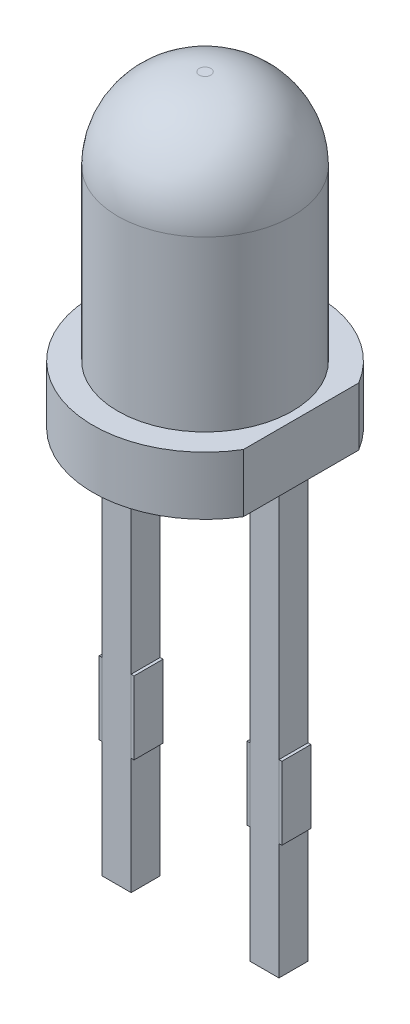
ISO-10303-21;
HEADER;
FILE_DESCRIPTION(('STEP AP214'),'2;1');
FILE_NAME('part.step','',(''),(''),'','','');
FILE_SCHEMA(('AUTOMOTIVE_DESIGN { 1 0 10303 214 1 1 1 1 }'));
ENDSEC;
DATA;
#1=APPLICATION_CONTEXT('core data for automotive mechanical design processes');
#2=APPLICATION_PROTOCOL_DEFINITION('international standard','automotive_design',2000,#1);
#3=PRODUCT_CONTEXT('',#1,'mechanical');
#4=PRODUCT('Part','Part','',(#3));
#5=PRODUCT_RELATED_PRODUCT_CATEGORY('part','',(#4));
#6=PRODUCT_DEFINITION_FORMATION('','',#4);
#7=PRODUCT_DEFINITION_CONTEXT('part definition',#1,'design');
#8=PRODUCT_DEFINITION('design','',#6,#7);
#9=PRODUCT_DEFINITION_SHAPE('','',#8);
#10=(LENGTH_UNIT() NAMED_UNIT(*) SI_UNIT(.MILLI.,.METRE.));
#11=(NAMED_UNIT(*) PLANE_ANGLE_UNIT() SI_UNIT($,.RADIAN.));
#12=(NAMED_UNIT(*) SI_UNIT($,.STERADIAN.) SOLID_ANGLE_UNIT());
#13=UNCERTAINTY_MEASURE_WITH_UNIT(LENGTH_MEASURE(1.E-05),#10,'distance_accuracy_value','');
#14=(GEOMETRIC_REPRESENTATION_CONTEXT(3) GLOBAL_UNCERTAINTY_ASSIGNED_CONTEXT((#13)) GLOBAL_UNIT_ASSIGNED_CONTEXT((#10,
#11,#12)) REPRESENTATION_CONTEXT('',''));
#15=CARTESIAN_POINT('',(0.,0.,0.));
#16=DIRECTION('',(0.,0.,1.));
#17=DIRECTION('',(1.,0.,0.));
#18=AXIS2_PLACEMENT_3D('',#15,#16,#17);
#19=CARTESIAN_POINT('',(1.56997753376959,1.25,0.249999999999999));
#20=DIRECTION('',(0.,0.,1.));
#21=DIRECTION('',(1.,0.,0.));
#22=AXIS2_PLACEMENT_3D('',#19,#20,#21);
#23=PLANE('',#22);
#24=DIRECTION('',(1.,0.,0.));
#25=VECTOR('',#24,1.);
#26=CARTESIAN_POINT('',(1.26997753376959,0.,0.249999999999999));
#27=LINE('',#26,#25);
#28=CARTESIAN_POINT('',(1.56997753376959,0.,0.249999999999999));
#29=VERTEX_POINT('',#28);
#30=CARTESIAN_POINT('',(0.969977533769589,0.,0.249999999999999));
#31=VERTEX_POINT('',#30);
#32=EDGE_CURVE('P0_E69',#29,#31,#27,.F.);
#33=ORIENTED_EDGE('',*,*,#32,.F.);
#34=DIRECTION('',(0.,1.,0.));
#35=VECTOR('',#34,1.);
#36=CARTESIAN_POINT('',(1.56997753376959,1.25,0.249999999999999));
#37=LINE('',#36,#35);
#38=CARTESIAN_POINT('',(1.56997753376959,1.25,0.249999999999999));
#39=VERTEX_POINT('',#38);
#40=EDGE_CURVE('P0_E56',#39,#29,#37,.F.);
#41=ORIENTED_EDGE('',*,*,#40,.F.);
#42=DIRECTION('',(-1.,0.,0.));
#43=VECTOR('',#42,1.);
#44=CARTESIAN_POINT('',(1.26997753376959,1.25,0.249999999999999));
#45=LINE('',#44,#43);
#46=CARTESIAN_POINT('',(0.969977533769589,1.25,0.249999999999999));
#47=VERTEX_POINT('',#46);
#48=EDGE_CURVE('P0_E21',#47,#39,#45,.F.);
#49=ORIENTED_EDGE('',*,*,#48,.F.);
#50=DIRECTION('',(0.,1.,0.));
#51=VECTOR('',#50,1.);
#52=CARTESIAN_POINT('',(0.969977533769589,1.25,0.249999999999999));
#53=LINE('',#52,#51);
#54=EDGE_CURVE('P0_E82',#31,#47,#53,.T.);
#55=ORIENTED_EDGE('',*,*,#54,.F.);
#56=EDGE_LOOP('',(#33,#41,#49,#55));
#57=FACE_BOUND('',#56,.T.);
#58=ADVANCED_FACE('P0_F18',(#57),#23,.T.);
#59=CARTESIAN_POINT('',(1.26997753376959,1.25,0.));
#60=DIRECTION('',(0.,1.,0.));
#61=DIRECTION('',(-1.,0.,0.));
#62=AXIS2_PLACEMENT_3D('',#59,#60,#61);
#63=PLANE('',#62);
#64=DIRECTION('',(0.,0.,1.));
#65=VECTOR('',#64,1.);
#66=CARTESIAN_POINT('',(0.969977533769589,1.25,0.249999999999999));
#67=LINE('',#66,#65);
#68=CARTESIAN_POINT('',(0.969977533769589,1.25,-0.250000000000001));
#69=VERTEX_POINT('',#68);
#70=EDGE_CURVE('P0_E65',#47,#69,#67,.F.);
#71=ORIENTED_EDGE('',*,*,#70,.F.);
#72=ORIENTED_EDGE('',*,*,#48,.T.);
#73=DIRECTION('',(0.,0.,-1.));
#74=VECTOR('',#73,1.);
#75=CARTESIAN_POINT('',(1.56997753376959,1.25,-0.250000000000001));
#76=LINE('',#75,#74);
#77=CARTESIAN_POINT('',(1.56997753376959,1.25,-0.250000000000001));
#78=VERTEX_POINT('',#77);
#79=EDGE_CURVE('P0_E62',#78,#39,#76,.F.);
#80=ORIENTED_EDGE('',*,*,#79,.F.);
#81=DIRECTION('',(-1.,0.,0.));
#82=VECTOR('',#81,1.);
#83=CARTESIAN_POINT('',(0.969977533769589,1.25,-0.250000000000001));
#84=LINE('',#83,#82);
#85=EDGE_CURVE('P0_E84',#69,#78,#84,.F.);
#86=ORIENTED_EDGE('',*,*,#85,.F.);
#87=EDGE_LOOP('',(#71,#72,#80,#86));
#88=FACE_BOUND('',#87,.T.);
#89=ADVANCED_FACE('P0_F61',(#88),#63,.T.);
#90=CARTESIAN_POINT('',(1.56997753376959,1.25,-0.250000000000001));
#91=DIRECTION('',(1.,0.,0.));
#92=DIRECTION('',(0.,0.,-1.));
#93=AXIS2_PLACEMENT_3D('',#90,#91,#92);
#94=PLANE('',#93);
#95=DIRECTION('',(0.,0.,1.));
#96=VECTOR('',#95,1.);
#97=CARTESIAN_POINT('',(1.56997753376959,0.,0.));
#98=LINE('',#97,#96);
#99=CARTESIAN_POINT('',(1.56997753376959,0.,-0.250000000000001));
#100=VERTEX_POINT('',#99);
#101=EDGE_CURVE('P0_E71',#100,#29,#98,.T.);
#102=ORIENTED_EDGE('',*,*,#101,.F.);
#103=DIRECTION('',(0.,1.,0.));
#104=VECTOR('',#103,1.);
#105=CARTESIAN_POINT('',(1.56997753376959,1.25,-0.250000000000001));
#106=LINE('',#105,#104);
#107=EDGE_CURVE('P0_E75',#78,#100,#106,.F.);
#108=ORIENTED_EDGE('',*,*,#107,.F.);
#109=ORIENTED_EDGE('',*,*,#79,.T.);
#110=ORIENTED_EDGE('',*,*,#40,.T.);
#111=EDGE_LOOP('',(#102,#108,#109,#110));
#112=FACE_BOUND('',#111,.T.);
#113=ADVANCED_FACE('P0_F73',(#112),#94,.T.);
#114=CARTESIAN_POINT('',(1.26997753376959,0.,0.));
#115=DIRECTION('',(0.,-1.,0.));
#116=DIRECTION('',(1.,0.,0.));
#117=AXIS2_PLACEMENT_3D('',#114,#115,#116);
#118=PLANE('',#117);
#119=DIRECTION('',(0.,0.,1.));
#120=VECTOR('',#119,1.);
#121=CARTESIAN_POINT('',(0.969977533769589,0.,0.249999999999999));
#122=LINE('',#121,#120);
#123=CARTESIAN_POINT('',(0.969977533769589,0.,-0.250000000000001));
#124=VERTEX_POINT('',#123);
#125=EDGE_CURVE('P0_E36',#124,#31,#122,.T.);
#126=ORIENTED_EDGE('',*,*,#125,.F.);
#127=DIRECTION('',(-1.,0.,0.));
#128=VECTOR('',#127,1.);
#129=CARTESIAN_POINT('',(0.969977533769589,0.,-0.250000000000001));
#130=LINE('',#129,#128);
#131=EDGE_CURVE('P0_E27',#100,#124,#130,.T.);
#132=ORIENTED_EDGE('',*,*,#131,.F.);
#133=ORIENTED_EDGE('',*,*,#101,.T.);
#134=ORIENTED_EDGE('',*,*,#32,.T.);
#135=EDGE_LOOP('',(#126,#132,#133,#134));
#136=FACE_BOUND('',#135,.T.);
#137=ADVANCED_FACE('P0_F90',(#136),#118,.T.);
#138=CARTESIAN_POINT('',(0.969977533769589,1.25,0.249999999999999));
#139=DIRECTION('',(-1.,0.,0.));
#140=DIRECTION('',(0.,0.,1.));
#141=AXIS2_PLACEMENT_3D('',#138,#139,#140);
#142=PLANE('',#141);
#143=ORIENTED_EDGE('',*,*,#125,.T.);
#144=ORIENTED_EDGE('',*,*,#54,.T.);
#145=ORIENTED_EDGE('',*,*,#70,.T.);
#146=DIRECTION('',(0.,1.,0.));
#147=VECTOR('',#146,1.);
#148=CARTESIAN_POINT('',(0.969977533769589,1.25,-0.250000000000001));
#149=LINE('',#148,#147);
#150=EDGE_CURVE('P0_E11',#124,#69,#149,.T.);
#151=ORIENTED_EDGE('',*,*,#150,.F.);
#152=EDGE_LOOP('',(#143,#144,#145,#151));
#153=FACE_BOUND('',#152,.T.);
#154=ADVANCED_FACE('P0_F92',(#153),#142,.T.);
#155=CARTESIAN_POINT('',(0.969977533769589,1.25,-0.250000000000001));
#156=DIRECTION('',(0.,0.,-1.));
#157=DIRECTION('',(-1.,0.,0.));
#158=AXIS2_PLACEMENT_3D('',#155,#156,#157);
#159=PLANE('',#158);
#160=ORIENTED_EDGE('',*,*,#131,.T.);
#161=ORIENTED_EDGE('',*,*,#150,.T.);
#162=ORIENTED_EDGE('',*,*,#85,.T.);
#163=ORIENTED_EDGE('',*,*,#107,.T.);
#164=EDGE_LOOP('',(#160,#161,#162,#163));
#165=FACE_BOUND('',#164,.T.);
#166=ADVANCED_FACE('P0_F89',(#165),#159,.T.);
#167=CLOSED_SHELL('',(#58,#89,#113,#137,#154,#166));
#168=MANIFOLD_SOLID_BREP('P0_B1',#167);
#169=CARTESIAN_POINT('',(-1.01999994039536,5.3,0.249999999999999));
#170=DIRECTION('',(0.,0.,1.));
#171=DIRECTION('',(1.,0.,0.));
#172=AXIS2_PLACEMENT_3D('',#169,#170,#171);
#173=PLANE('',#172);
#174=DIRECTION('',(1.,0.,0.));
#175=VECTOR('',#174,1.);
#176=CARTESIAN_POINT('',(-1.26999994039536,-2.,0.249999999999999));
#177=LINE('',#176,#175);
#178=CARTESIAN_POINT('',(-1.01999994039536,-2.,0.249999999999999));
#179=VERTEX_POINT('',#178);
#180=CARTESIAN_POINT('',(-1.51999994039536,-2.,0.249999999999999));
#181=VERTEX_POINT('',#180);
#182=EDGE_CURVE('P1_E69',#179,#181,#177,.F.);
#183=ORIENTED_EDGE('',*,*,#182,.F.);
#184=DIRECTION('',(0.,1.,0.));
#185=VECTOR('',#184,1.);
#186=CARTESIAN_POINT('',(-1.01999994039536,5.3,0.249999999999999));
#187=LINE('',#186,#185);
#188=CARTESIAN_POINT('',(-1.01999994039536,5.3,0.249999999999999));
#189=VERTEX_POINT('',#188);
#190=EDGE_CURVE('P1_E56',#189,#179,#187,.F.);
#191=ORIENTED_EDGE('',*,*,#190,.F.);
#192=DIRECTION('',(-1.,0.,0.));
#193=VECTOR('',#192,1.);
#194=CARTESIAN_POINT('',(-1.26999994039536,5.3,0.249999999999999));
#195=LINE('',#194,#193);
#196=CARTESIAN_POINT('',(-1.51999994039536,5.3,0.249999999999999));
#197=VERTEX_POINT('',#196);
#198=EDGE_CURVE('P1_E21',#197,#189,#195,.F.);
#199=ORIENTED_EDGE('',*,*,#198,.F.);
#200=DIRECTION('',(0.,1.,0.));
#201=VECTOR('',#200,1.);
#202=CARTESIAN_POINT('',(-1.51999994039536,5.3,0.249999999999999));
#203=LINE('',#202,#201);
#204=EDGE_CURVE('P1_E82',#181,#197,#203,.T.);
#205=ORIENTED_EDGE('',*,*,#204,.F.);
#206=EDGE_LOOP('',(#183,#191,#199,#205));
#207=FACE_BOUND('',#206,.T.);
#208=ADVANCED_FACE('P1_F18',(#207),#173,.T.);
#209=CARTESIAN_POINT('',(-1.26999994039536,5.3,0.));
#210=DIRECTION('',(0.,1.,0.));
#211=DIRECTION('',(-1.,0.,0.));
#212=AXIS2_PLACEMENT_3D('',#209,#210,#211);
#213=PLANE('',#212);
#214=DIRECTION('',(0.,0.,1.));
#215=VECTOR('',#214,1.);
#216=CARTESIAN_POINT('',(-1.51999994039536,5.3,0.249999999999999));
#217=LINE('',#216,#215);
#218=CARTESIAN_POINT('',(-1.51999994039536,5.3,-0.250000000000001));
#219=VERTEX_POINT('',#218);
#220=EDGE_CURVE('P1_E65',#197,#219,#217,.F.);
#221=ORIENTED_EDGE('',*,*,#220,.F.);
#222=ORIENTED_EDGE('',*,*,#198,.T.);
#223=DIRECTION('',(0.,0.,-1.));
#224=VECTOR('',#223,1.);
#225=CARTESIAN_POINT('',(-1.01999994039536,5.3,-0.250000000000001));
#226=LINE('',#225,#224);
#227=CARTESIAN_POINT('',(-1.01999994039536,5.3,-0.250000000000001));
#228=VERTEX_POINT('',#227);
#229=EDGE_CURVE('P1_E62',#228,#189,#226,.F.);
#230=ORIENTED_EDGE('',*,*,#229,.F.);
#231=DIRECTION('',(-1.,0.,0.));
#232=VECTOR('',#231,1.);
#233=CARTESIAN_POINT('',(-1.51999994039536,5.3,-0.250000000000001));
#234=LINE('',#233,#232);
#235=EDGE_CURVE('P1_E84',#219,#228,#234,.F.);
#236=ORIENTED_EDGE('',*,*,#235,.F.);
#237=EDGE_LOOP('',(#221,#222,#230,#236));
#238=FACE_BOUND('',#237,.T.);
#239=ADVANCED_FACE('P1_F61',(#238),#213,.T.);
#240=CARTESIAN_POINT('',(-1.01999994039536,5.3,-0.250000000000001));
#241=DIRECTION('',(1.,0.,0.));
#242=DIRECTION('',(0.,0.,-1.));
#243=AXIS2_PLACEMENT_3D('',#240,#241,#242);
#244=PLANE('',#243);
#245=DIRECTION('',(0.,0.,1.));
#246=VECTOR('',#245,1.);
#247=CARTESIAN_POINT('',(-1.01999994039536,-2.,0.));
#248=LINE('',#247,#246);
#249=CARTESIAN_POINT('',(-1.01999994039536,-2.,-0.250000000000001));
#250=VERTEX_POINT('',#249);
#251=EDGE_CURVE('P1_E71',#250,#179,#248,.T.);
#252=ORIENTED_EDGE('',*,*,#251,.F.);
#253=DIRECTION('',(0.,1.,0.));
#254=VECTOR('',#253,1.);
#255=CARTESIAN_POINT('',(-1.01999994039536,5.3,-0.250000000000001));
#256=LINE('',#255,#254);
#257=EDGE_CURVE('P1_E75',#228,#250,#256,.F.);
#258=ORIENTED_EDGE('',*,*,#257,.F.);
#259=ORIENTED_EDGE('',*,*,#229,.T.);
#260=ORIENTED_EDGE('',*,*,#190,.T.);
#261=EDGE_LOOP('',(#252,#258,#259,#260));
#262=FACE_BOUND('',#261,.T.);
#263=ADVANCED_FACE('P1_F73',(#262),#244,.T.);
#264=CARTESIAN_POINT('',(-1.26999994039536,-2.,0.));
#265=DIRECTION('',(0.,-1.,0.));
#266=DIRECTION('',(1.,0.,0.));
#267=AXIS2_PLACEMENT_3D('',#264,#265,#266);
#268=PLANE('',#267);
#269=DIRECTION('',(0.,0.,1.));
#270=VECTOR('',#269,1.);
#271=CARTESIAN_POINT('',(-1.51999994039536,-2.,0.249999999999999));
#272=LINE('',#271,#270);
#273=CARTESIAN_POINT('',(-1.51999994039536,-2.,-0.250000000000001));
#274=VERTEX_POINT('',#273);
#275=EDGE_CURVE('P1_E36',#274,#181,#272,.T.);
#276=ORIENTED_EDGE('',*,*,#275,.F.);
#277=DIRECTION('',(-1.,0.,0.));
#278=VECTOR('',#277,1.);
#279=CARTESIAN_POINT('',(-1.51999994039536,-2.,-0.250000000000001));
#280=LINE('',#279,#278);
#281=EDGE_CURVE('P1_E27',#250,#274,#280,.T.);
#282=ORIENTED_EDGE('',*,*,#281,.F.);
#283=ORIENTED_EDGE('',*,*,#251,.T.);
#284=ORIENTED_EDGE('',*,*,#182,.T.);
#285=EDGE_LOOP('',(#276,#282,#283,#284));
#286=FACE_BOUND('',#285,.T.);
#287=ADVANCED_FACE('P1_F90',(#286),#268,.T.);
#288=CARTESIAN_POINT('',(-1.51999994039536,5.3,0.249999999999999));
#289=DIRECTION('',(-1.,0.,0.));
#290=DIRECTION('',(0.,0.,1.));
#291=AXIS2_PLACEMENT_3D('',#288,#289,#290);
#292=PLANE('',#291);
#293=ORIENTED_EDGE('',*,*,#275,.T.);
#294=ORIENTED_EDGE('',*,*,#204,.T.);
#295=ORIENTED_EDGE('',*,*,#220,.T.);
#296=DIRECTION('',(0.,1.,0.));
#297=VECTOR('',#296,1.);
#298=CARTESIAN_POINT('',(-1.51999994039536,5.3,-0.250000000000001));
#299=LINE('',#298,#297);
#300=EDGE_CURVE('P1_E11',#274,#219,#299,.T.);
#301=ORIENTED_EDGE('',*,*,#300,.F.);
#302=EDGE_LOOP('',(#293,#294,#295,#301));
#303=FACE_BOUND('',#302,.T.);
#304=ADVANCED_FACE('P1_F92',(#303),#292,.T.);
#305=CARTESIAN_POINT('',(-1.51999994039536,5.3,-0.250000000000001));
#306=DIRECTION('',(0.,0.,-1.));
#307=DIRECTION('',(-1.,0.,0.));
#308=AXIS2_PLACEMENT_3D('',#305,#306,#307);
#309=PLANE('',#308);
#310=ORIENTED_EDGE('',*,*,#281,.T.);
#311=ORIENTED_EDGE('',*,*,#300,.T.);
#312=ORIENTED_EDGE('',*,*,#235,.T.);
#313=ORIENTED_EDGE('',*,*,#257,.T.);
#314=EDGE_LOOP('',(#310,#311,#312,#313));
#315=FACE_BOUND('',#314,.T.);
#316=ADVANCED_FACE('P1_F89',(#315),#309,.T.);
#317=CLOSED_SHELL('',(#208,#239,#263,#287,#304,#316));
#318=MANIFOLD_SOLID_BREP('P1_B1',#317);
#319=CARTESIAN_POINT('',(0.,5.3,0.));
#320=DIRECTION('',(0.,-1.,0.));
#321=DIRECTION('',(0.,0.,-1.));
#322=AXIS2_PLACEMENT_3D('',#319,#320,#321);
#323=PLANE('',#322);
#324=DIRECTION('',(0.,0.,1.));
#325=VECTOR('',#324,1.);
#326=CARTESIAN_POINT('',(1.65025321659662,5.3,-3.00000004470348));
#327=LINE('',#326,#325);
#328=CARTESIAN_POINT('',(1.65025321659662,5.3,-0.991105100941625));
#329=VERTEX_POINT('',#328);
#330=CARTESIAN_POINT('',(1.65025321659662,5.3,0.991105100941623));
#331=VERTEX_POINT('',#330);
#332=EDGE_CURVE('P2_E51',#329,#331,#327,.T.);
#333=ORIENTED_EDGE('',*,*,#332,.T.);
#334=CARTESIAN_POINT('',(0.,5.3,0.));
#335=DIRECTION('',(0.,1.,0.));
#336=DIRECTION('',(0.,0.,1.));
#337=AXIS2_PLACEMENT_3D('',#334,#335,#336);
#338=CIRCLE('',#337,1.925);
#339=EDGE_CURVE('P2_E23',#329,#331,#338,.T.);
#340=ORIENTED_EDGE('',*,*,#339,.F.);
#341=EDGE_LOOP('',(#333,#340));
#342=FACE_BOUND('',#341,.T.);
#343=ADVANCED_FACE('P2_F19',(#342),#323,.T.);
#344=CARTESIAN_POINT('',(1.65025321659662,5.3,-3.00000004470348));
#345=DIRECTION('',(-1.,0.,0.));
#346=DIRECTION('',(0.,0.,1.));
#347=AXIS2_PLACEMENT_3D('',#344,#345,#346);
#348=PLANE('',#347);
#349=DIRECTION('',(0.,0.,1.));
#350=VECTOR('',#349,1.);
#351=CARTESIAN_POINT('',(1.65025321659662,6.3,0.));
#352=LINE('',#351,#350);
#353=CARTESIAN_POINT('',(1.65025321659662,6.3,0.991105100941622));
#354=VERTEX_POINT('',#353);
#355=CARTESIAN_POINT('',(1.65025321659662,6.3,-0.991105100941625));
#356=VERTEX_POINT('',#355);
#357=EDGE_CURVE('P2_E62',#354,#356,#352,.F.);
#358=ORIENTED_EDGE('',*,*,#357,.F.);
#359=DIRECTION('',(0.,1.,0.));
#360=VECTOR('',#359,1.);
#361=CARTESIAN_POINT('',(1.65025321659662,5.8,0.991105100941621));
#362=LINE('',#361,#360);
#363=EDGE_CURVE('P2_E59',#331,#354,#362,.T.);
#364=ORIENTED_EDGE('',*,*,#363,.F.);
#365=ORIENTED_EDGE('',*,*,#332,.F.);
#366=DIRECTION('',(0.,1.,0.));
#367=VECTOR('',#366,1.);
#368=CARTESIAN_POINT('',(1.65025321659662,5.8,-0.991105100941623));
#369=LINE('',#368,#367);
#370=EDGE_CURVE('P2_E56',#356,#329,#369,.F.);
#371=ORIENTED_EDGE('',*,*,#370,.F.);
#372=EDGE_LOOP('',(#358,#364,#365,#371));
#373=FACE_BOUND('',#372,.T.);
#374=ADVANCED_FACE('P2_F60',(#373),#348,.F.);
#375=CARTESIAN_POINT('',(0.,5.8,0.));
#376=DIRECTION('',(0.,1.,0.));
#377=DIRECTION('',(0.,0.,1.));
#378=AXIS2_PLACEMENT_3D('',#375,#376,#377);
#379=CYLINDRICAL_SURFACE('',#378,1.925);
#380=ORIENTED_EDGE('',*,*,#363,.T.);
#381=CARTESIAN_POINT('',(0.,6.3,0.));
#382=DIRECTION('',(0.,1.,0.));
#383=DIRECTION('',(0.,0.,1.));
#384=AXIS2_PLACEMENT_3D('',#381,#382,#383);
#385=CIRCLE('',#384,1.925);
#386=EDGE_CURVE('P2_E72',#356,#354,#385,.T.);
#387=ORIENTED_EDGE('',*,*,#386,.F.);
#388=ORIENTED_EDGE('',*,*,#370,.T.);
#389=ORIENTED_EDGE('',*,*,#339,.T.);
#390=EDGE_LOOP('',(#380,#387,#388,#389));
#391=FACE_BOUND('',#390,.T.);
#392=ADVANCED_FACE('P2_F67',(#391),#379,.T.);
#393=CARTESIAN_POINT('',(0.,10.6,0.));
#394=DIRECTION('',(0.,1.,0.));
#395=DIRECTION('',(0.,0.,1.));
#396=AXIS2_PLACEMENT_3D('',#393,#394,#395);
#397=PLANE('',#396);
#398=CARTESIAN_POINT('',(0.,10.6,0.));
#399=DIRECTION('',(0.,1.,0.));
#400=DIRECTION('',(0.,0.,1.));
#401=AXIS2_PLACEMENT_3D('',#398,#399,#400);
#402=CIRCLE('',#401,0.0999999999999999);
#403=CARTESIAN_POINT('',(0.,10.6,-0.100000000000003));
#404=VERTEX_POINT('',#403);
#405=CARTESIAN_POINT('',(0.0999999999999999,10.6,0.));
#406=VERTEX_POINT('',#405);
#407=EDGE_CURVE('P2_E37',#404,#406,#402,.T.);
#408=ORIENTED_EDGE('',*,*,#407,.T.);
#409=CARTESIAN_POINT('',(0.1,10.6,0.));
#410=CARTESIAN_POINT('',(0.1,10.6,-0.0408974612727251));
#411=CARTESIAN_POINT('',(0.0707106781186548,10.6,-0.0707106781186573));
#412=CARTESIAN_POINT('',(0.041936045018768,10.6,-0.100000000000003));
#413=CARTESIAN_POINT('',(0.,10.6,-0.100000000000003));
#414=B_SPLINE_CURVE_WITH_KNOTS('',2,(#409,#410,#411,#412,#413),.UNSPECIFIED.,.F.,.F.,(3,2,3),
(0.,0.5,1.),.UNSPECIFIED.);
#415=EDGE_CURVE('P2_E71',#406,#404,#414,.T.);
#416=ORIENTED_EDGE('',*,*,#415,.T.);
#417=EDGE_LOOP('',(#408,#416));
#418=FACE_BOUND('',#417,.T.);
#419=ADVANCED_FACE('P2_F80',(#418),#397,.T.);
#420=CARTESIAN_POINT('',(0.,6.3,0.));
#421=DIRECTION('',(0.,1.,0.));
#422=DIRECTION('',(0.,0.,1.));
#423=AXIS2_PLACEMENT_3D('',#420,#421,#422);
#424=PLANE('',#423);
#425=CARTESIAN_POINT('',(0.,6.3,0.));
#426=DIRECTION('',(0.,1.,0.));
#427=DIRECTION('',(0.,0.,1.));
#428=AXIS2_PLACEMENT_3D('',#425,#426,#427);
#429=CIRCLE('',#428,1.5);
#430=CARTESIAN_POINT('',(0.,6.3,1.5));
#431=VERTEX_POINT('',#430);
#432=EDGE_CURVE('P2_E11',#431,#431,#429,.T.);
#433=ORIENTED_EDGE('',*,*,#432,.F.);
#434=EDGE_LOOP('',(#433));
#435=FACE_BOUND('',#434,.T.);
#436=ORIENTED_EDGE('',*,*,#357,.T.);
#437=ORIENTED_EDGE('',*,*,#386,.T.);
#438=EDGE_LOOP('',(#436,#437));
#439=FACE_BOUND('',#438,.T.);
#440=ADVANCED_FACE('P2_F90',(#435,#439),#424,.T.);
#441=CARTESIAN_POINT('',(0.,9.2,0.));
#442=DIRECTION('',(0.,1.,0.));
#443=DIRECTION('',(0.,0.,1.));
#444=AXIS2_PLACEMENT_3D('',#441,#442,#443);
#445=DEGENERATE_TOROIDAL_SURFACE('',#444,0.100000000000001,1.4,.T.);
#446=CARTESIAN_POINT('',(0.,9.2,0.));
#447=DIRECTION('',(0.,1.,0.));
#448=DIRECTION('',(0.,0.,1.));
#449=AXIS2_PLACEMENT_3D('',#446,#447,#448);
#450=CIRCLE('',#449,1.5);
#451=CARTESIAN_POINT('',(0.,9.2,1.5));
#452=VERTEX_POINT('',#451);
#453=EDGE_CURVE('P2_E29',#452,#452,#450,.F.);
#454=ORIENTED_EDGE('',*,*,#453,.F.);
#455=EDGE_LOOP('',(#454));
#456=FACE_BOUND('',#455,.T.);
#457=ORIENTED_EDGE('',*,*,#407,.F.);
#458=ORIENTED_EDGE('',*,*,#415,.F.);
#459=EDGE_LOOP('',(#457,#458));
#460=FACE_BOUND('',#459,.T.);
#461=ADVANCED_FACE('P2_F21',(#456,#460),#445,.T.);
#462=CARTESIAN_POINT('',(0.,7.95,0.));
#463=DIRECTION('',(0.,1.,0.));
#464=DIRECTION('',(0.,0.,1.));
#465=AXIS2_PLACEMENT_3D('',#462,#463,#464);
#466=CYLINDRICAL_SURFACE('',#465,1.5);
#467=ORIENTED_EDGE('',*,*,#432,.T.);
#468=EDGE_LOOP('',(#467));
#469=FACE_BOUND('',#468,.T.);
#470=ORIENTED_EDGE('',*,*,#453,.T.);
#471=EDGE_LOOP('',(#470));
#472=FACE_BOUND('',#471,.T.);
#473=ADVANCED_FACE('P2_F99',(#469,#472),#466,.T.);
#474=CLOSED_SHELL('',(#343,#374,#392,#419,#440,#461,#473));
#475=MANIFOLD_SOLID_BREP('P2_B1',#474);
#476=CARTESIAN_POINT('',(1.52000005960464,5.3,0.249999999999999));
#477=DIRECTION('',(0.,0.,1.));
#478=DIRECTION('',(1.,0.,0.));
#479=AXIS2_PLACEMENT_3D('',#476,#477,#478);
#480=PLANE('',#479);
#481=DIRECTION('',(1.,0.,0.));
#482=VECTOR('',#481,1.);
#483=CARTESIAN_POINT('',(1.27000005960464,-2.,0.249999999999999));
#484=LINE('',#483,#482);
#485=CARTESIAN_POINT('',(1.52000005960464,-2.,0.249999999999999));
#486=VERTEX_POINT('',#485);
#487=CARTESIAN_POINT('',(1.02000005960464,-2.,0.249999999999999));
#488=VERTEX_POINT('',#487);
#489=EDGE_CURVE('P3_E69',#486,#488,#484,.F.);
#490=ORIENTED_EDGE('',*,*,#489,.F.);
#491=DIRECTION('',(0.,1.,0.));
#492=VECTOR('',#491,1.);
#493=CARTESIAN_POINT('',(1.52000005960464,5.3,0.249999999999999));
#494=LINE('',#493,#492);
#495=CARTESIAN_POINT('',(1.52000005960464,5.3,0.249999999999999));
#496=VERTEX_POINT('',#495);
#497=EDGE_CURVE('P3_E56',#496,#486,#494,.F.);
#498=ORIENTED_EDGE('',*,*,#497,.F.);
#499=DIRECTION('',(-1.,0.,0.));
#500=VECTOR('',#499,1.);
#501=CARTESIAN_POINT('',(1.27000005960464,5.3,0.249999999999999));
#502=LINE('',#501,#500);
#503=CARTESIAN_POINT('',(1.02000005960464,5.3,0.249999999999999));
#504=VERTEX_POINT('',#503);
#505=EDGE_CURVE('P3_E21',#504,#496,#502,.F.);
#506=ORIENTED_EDGE('',*,*,#505,.F.);
#507=DIRECTION('',(0.,1.,0.));
#508=VECTOR('',#507,1.);
#509=CARTESIAN_POINT('',(1.02000005960464,5.3,0.249999999999999));
#510=LINE('',#509,#508);
#511=EDGE_CURVE('P3_E82',#488,#504,#510,.T.);
#512=ORIENTED_EDGE('',*,*,#511,.F.);
#513=EDGE_LOOP('',(#490,#498,#506,#512));
#514=FACE_BOUND('',#513,.T.);
#515=ADVANCED_FACE('P3_F18',(#514),#480,.T.);
#516=CARTESIAN_POINT('',(1.27000005960464,5.3,0.));
#517=DIRECTION('',(0.,1.,0.));
#518=DIRECTION('',(-1.,0.,0.));
#519=AXIS2_PLACEMENT_3D('',#516,#517,#518);
#520=PLANE('',#519);
#521=DIRECTION('',(0.,0.,1.));
#522=VECTOR('',#521,1.);
#523=CARTESIAN_POINT('',(1.02000005960464,5.3,0.249999999999999));
#524=LINE('',#523,#522);
#525=CARTESIAN_POINT('',(1.02000005960464,5.3,-0.250000000000001));
#526=VERTEX_POINT('',#525);
#527=EDGE_CURVE('P3_E65',#504,#526,#524,.F.);
#528=ORIENTED_EDGE('',*,*,#527,.F.);
#529=ORIENTED_EDGE('',*,*,#505,.T.);
#530=DIRECTION('',(0.,0.,-1.));
#531=VECTOR('',#530,1.);
#532=CARTESIAN_POINT('',(1.52000005960464,5.3,-0.250000000000001));
#533=LINE('',#532,#531);
#534=CARTESIAN_POINT('',(1.52000005960464,5.3,-0.250000000000001));
#535=VERTEX_POINT('',#534);
#536=EDGE_CURVE('P3_E62',#535,#496,#533,.F.);
#537=ORIENTED_EDGE('',*,*,#536,.F.);
#538=DIRECTION('',(-1.,0.,0.));
#539=VECTOR('',#538,1.);
#540=CARTESIAN_POINT('',(1.02000005960464,5.3,-0.250000000000001));
#541=LINE('',#540,#539);
#542=EDGE_CURVE('P3_E84',#526,#535,#541,.F.);
#543=ORIENTED_EDGE('',*,*,#542,.F.);
#544=EDGE_LOOP('',(#528,#529,#537,#543));
#545=FACE_BOUND('',#544,.T.);
#546=ADVANCED_FACE('P3_F61',(#545),#520,.T.);
#547=CARTESIAN_POINT('',(1.52000005960464,5.3,-0.250000000000001));
#548=DIRECTION('',(1.,0.,0.));
#549=DIRECTION('',(0.,0.,-1.));
#550=AXIS2_PLACEMENT_3D('',#547,#548,#549);
#551=PLANE('',#550);
#552=DIRECTION('',(0.,0.,1.));
#553=VECTOR('',#552,1.);
#554=CARTESIAN_POINT('',(1.52000005960464,-2.,0.));
#555=LINE('',#554,#553);
#556=CARTESIAN_POINT('',(1.52000005960464,-2.,-0.250000000000001));
#557=VERTEX_POINT('',#556);
#558=EDGE_CURVE('P3_E71',#557,#486,#555,.T.);
#559=ORIENTED_EDGE('',*,*,#558,.F.);
#560=DIRECTION('',(0.,1.,0.));
#561=VECTOR('',#560,1.);
#562=CARTESIAN_POINT('',(1.52000005960464,5.3,-0.250000000000001));
#563=LINE('',#562,#561);
#564=EDGE_CURVE('P3_E75',#535,#557,#563,.F.);
#565=ORIENTED_EDGE('',*,*,#564,.F.);
#566=ORIENTED_EDGE('',*,*,#536,.T.);
#567=ORIENTED_EDGE('',*,*,#497,.T.);
#568=EDGE_LOOP('',(#559,#565,#566,#567));
#569=FACE_BOUND('',#568,.T.);
#570=ADVANCED_FACE('P3_F73',(#569),#551,.T.);
#571=CARTESIAN_POINT('',(1.27000005960464,-2.,0.));
#572=DIRECTION('',(0.,-1.,0.));
#573=DIRECTION('',(1.,0.,0.));
#574=AXIS2_PLACEMENT_3D('',#571,#572,#573);
#575=PLANE('',#574);
#576=DIRECTION('',(0.,0.,1.));
#577=VECTOR('',#576,1.);
#578=CARTESIAN_POINT('',(1.02000005960464,-2.,0.249999999999999));
#579=LINE('',#578,#577);
#580=CARTESIAN_POINT('',(1.02000005960464,-2.,-0.250000000000001));
#581=VERTEX_POINT('',#580);
#582=EDGE_CURVE('P3_E36',#581,#488,#579,.T.);
#583=ORIENTED_EDGE('',*,*,#582,.F.);
#584=DIRECTION('',(-1.,0.,0.));
#585=VECTOR('',#584,1.);
#586=CARTESIAN_POINT('',(1.02000005960464,-2.,-0.250000000000001));
#587=LINE('',#586,#585);
#588=EDGE_CURVE('P3_E27',#557,#581,#587,.T.);
#589=ORIENTED_EDGE('',*,*,#588,.F.);
#590=ORIENTED_EDGE('',*,*,#558,.T.);
#591=ORIENTED_EDGE('',*,*,#489,.T.);
#592=EDGE_LOOP('',(#583,#589,#590,#591));
#593=FACE_BOUND('',#592,.T.);
#594=ADVANCED_FACE('P3_F90',(#593),#575,.T.);
#595=CARTESIAN_POINT('',(1.02000005960464,5.3,0.249999999999999));
#596=DIRECTION('',(-1.,0.,0.));
#597=DIRECTION('',(0.,0.,1.));
#598=AXIS2_PLACEMENT_3D('',#595,#596,#597);
#599=PLANE('',#598);
#600=ORIENTED_EDGE('',*,*,#582,.T.);
#601=ORIENTED_EDGE('',*,*,#511,.T.);
#602=ORIENTED_EDGE('',*,*,#527,.T.);
#603=DIRECTION('',(0.,1.,0.));
#604=VECTOR('',#603,1.);
#605=CARTESIAN_POINT('',(1.02000005960464,5.3,-0.250000000000001));
#606=LINE('',#605,#604);
#607=EDGE_CURVE('P3_E11',#581,#526,#606,.T.);
#608=ORIENTED_EDGE('',*,*,#607,.F.);
#609=EDGE_LOOP('',(#600,#601,#602,#608));
#610=FACE_BOUND('',#609,.T.);
#611=ADVANCED_FACE('P3_F92',(#610),#599,.T.);
#612=CARTESIAN_POINT('',(1.02000005960464,5.3,-0.250000000000001));
#613=DIRECTION('',(0.,0.,-1.));
#614=DIRECTION('',(-1.,0.,0.));
#615=AXIS2_PLACEMENT_3D('',#612,#613,#614);
#616=PLANE('',#615);
#617=ORIENTED_EDGE('',*,*,#588,.T.);
#618=ORIENTED_EDGE('',*,*,#607,.T.);
#619=ORIENTED_EDGE('',*,*,#542,.T.);
#620=ORIENTED_EDGE('',*,*,#564,.T.);
#621=EDGE_LOOP('',(#617,#618,#619,#620));
#622=FACE_BOUND('',#621,.T.);
#623=ADVANCED_FACE('P3_F89',(#622),#616,.T.);
#624=CLOSED_SHELL('',(#515,#546,#570,#594,#611,#623));
#625=MANIFOLD_SOLID_BREP('P3_B1',#624);
#626=CARTESIAN_POINT('',(-0.970022466230411,1.25,0.249999999999999));
#627=DIRECTION('',(0.,0.,1.));
#628=DIRECTION('',(1.,0.,0.));
#629=AXIS2_PLACEMENT_3D('',#626,#627,#628);
#630=PLANE('',#629);
#631=DIRECTION('',(1.,0.,0.));
#632=VECTOR('',#631,1.);
#633=CARTESIAN_POINT('',(-1.27002246623041,0.,0.249999999999999));
#634=LINE('',#633,#632);
#635=CARTESIAN_POINT('',(-0.970022466230411,0.,0.249999999999999));
#636=VERTEX_POINT('',#635);
#637=CARTESIAN_POINT('',(-1.57002246623041,0.,0.249999999999999));
#638=VERTEX_POINT('',#637);
#639=EDGE_CURVE('P4_E56',#636,#638,#634,.F.);
#640=ORIENTED_EDGE('',*,*,#639,.F.);
#641=DIRECTION('',(0.,1.,0.));
#642=VECTOR('',#641,1.);
#643=CARTESIAN_POINT('',(-0.970022466230411,1.25,0.249999999999999));
#644=LINE('',#643,#642);
#645=CARTESIAN_POINT('',(-0.970022466230411,1.25,0.249999999999999));
#646=VERTEX_POINT('',#645);
#647=EDGE_CURVE('P4_E68',#646,#636,#644,.F.);
#648=ORIENTED_EDGE('',*,*,#647,.F.);
#649=DIRECTION('',(-1.,0.,0.));
#650=VECTOR('',#649,1.);
#651=CARTESIAN_POINT('',(-1.27002246623041,1.25,0.249999999999999));
#652=LINE('',#651,#650);
#653=CARTESIAN_POINT('',(-1.57002246623041,1.25,0.249999999999999));
#654=VERTEX_POINT('',#653);
#655=EDGE_CURVE('P4_E21',#654,#646,#652,.F.);
#656=ORIENTED_EDGE('',*,*,#655,.F.);
#657=DIRECTION('',(0.,1.,0.));
#658=VECTOR('',#657,1.);
#659=CARTESIAN_POINT('',(-1.57002246623041,1.25,0.249999999999999));
#660=LINE('',#659,#658);
#661=EDGE_CURVE('P4_E82',#638,#654,#660,.T.);
#662=ORIENTED_EDGE('',*,*,#661,.F.);
#663=EDGE_LOOP('',(#640,#648,#656,#662));
#664=FACE_BOUND('',#663,.T.);
#665=ADVANCED_FACE('P4_F18',(#664),#630,.T.);
#666=CARTESIAN_POINT('',(-1.27002246623041,1.25,0.));
#667=DIRECTION('',(0.,1.,0.));
#668=DIRECTION('',(-1.,0.,0.));
#669=AXIS2_PLACEMENT_3D('',#666,#667,#668);
#670=PLANE('',#669);
#671=DIRECTION('',(-1.,0.,0.));
#672=VECTOR('',#671,1.);
#673=CARTESIAN_POINT('',(-1.57002246623041,1.25,-0.250000000000001));
#674=LINE('',#673,#672);
#675=CARTESIAN_POINT('',(-1.57002246623041,1.25,-0.250000000000001));
#676=VERTEX_POINT('',#675);
#677=CARTESIAN_POINT('',(-0.970022466230411,1.25,-0.250000000000001));
#678=VERTEX_POINT('',#677);
#679=EDGE_CURVE('P4_E84',#676,#678,#674,.F.);
#680=ORIENTED_EDGE('',*,*,#679,.F.);
#681=DIRECTION('',(0.,0.,1.));
#682=VECTOR('',#681,1.);
#683=CARTESIAN_POINT('',(-1.57002246623041,1.25,0.249999999999999));
#684=LINE('',#683,#682);
#685=EDGE_CURVE('P4_E66',#654,#676,#684,.F.);
#686=ORIENTED_EDGE('',*,*,#685,.F.);
#687=ORIENTED_EDGE('',*,*,#655,.T.);
#688=DIRECTION('',(0.,0.,-1.));
#689=VECTOR('',#688,1.);
#690=CARTESIAN_POINT('',(-0.970022466230411,1.25,-0.250000000000001));
#691=LINE('',#690,#689);
#692=EDGE_CURVE('P4_E63',#678,#646,#691,.F.);
#693=ORIENTED_EDGE('',*,*,#692,.F.);
#694=EDGE_LOOP('',(#680,#686,#687,#693));
#695=FACE_BOUND('',#694,.T.);
#696=ADVANCED_FACE('P4_F61',(#695),#670,.T.);
#697=CARTESIAN_POINT('',(-0.970022466230411,1.25,-0.250000000000001));
#698=DIRECTION('',(1.,0.,0.));
#699=DIRECTION('',(0.,0.,-1.));
#700=AXIS2_PLACEMENT_3D('',#697,#698,#699);
#701=PLANE('',#700);
#702=DIRECTION('',(0.,0.,1.));
#703=VECTOR('',#702,1.);
#704=CARTESIAN_POINT('',(-0.970022466230411,0.,0.));
#705=LINE('',#704,#703);
#706=CARTESIAN_POINT('',(-0.970022466230411,0.,-0.250000000000001));
#707=VERTEX_POINT('',#706);
#708=EDGE_CURVE('P4_E78',#707,#636,#705,.T.);
#709=ORIENTED_EDGE('',*,*,#708,.F.);
#710=DIRECTION('',(0.,1.,0.));
#711=VECTOR('',#710,1.);
#712=CARTESIAN_POINT('',(-0.970022466230411,1.25,-0.250000000000001));
#713=LINE('',#712,#711);
#714=EDGE_CURVE('P4_E74',#678,#707,#713,.F.);
#715=ORIENTED_EDGE('',*,*,#714,.F.);
#716=ORIENTED_EDGE('',*,*,#692,.T.);
#717=ORIENTED_EDGE('',*,*,#647,.T.);
#718=EDGE_LOOP('',(#709,#715,#716,#717));
#719=FACE_BOUND('',#718,.T.);
#720=ADVANCED_FACE('P4_F72',(#719),#701,.T.);
#721=CARTESIAN_POINT('',(-1.27002246623041,0.,0.));
#722=DIRECTION('',(0.,-1.,0.));
#723=DIRECTION('',(1.,0.,0.));
#724=AXIS2_PLACEMENT_3D('',#721,#722,#723);
#725=PLANE('',#724);
#726=DIRECTION('',(-1.,0.,0.));
#727=VECTOR('',#726,1.);
#728=CARTESIAN_POINT('',(-1.57002246623041,0.,-0.250000000000001));
#729=LINE('',#728,#727);
#730=CARTESIAN_POINT('',(-1.57002246623041,0.,-0.250000000000001));
#731=VERTEX_POINT('',#730);
#732=EDGE_CURVE('P4_E27',#707,#731,#729,.T.);
#733=ORIENTED_EDGE('',*,*,#732,.F.);
#734=ORIENTED_EDGE('',*,*,#708,.T.);
#735=ORIENTED_EDGE('',*,*,#639,.T.);
#736=DIRECTION('',(0.,0.,1.));
#737=VECTOR('',#736,1.);
#738=CARTESIAN_POINT('',(-1.57002246623041,0.,0.249999999999999));
#739=LINE('',#738,#737);
#740=EDGE_CURVE('P4_E36',#731,#638,#739,.T.);
#741=ORIENTED_EDGE('',*,*,#740,.F.);
#742=EDGE_LOOP('',(#733,#734,#735,#741));
#743=FACE_BOUND('',#742,.T.);
#744=ADVANCED_FACE('P4_F90',(#743),#725,.T.);
#745=CARTESIAN_POINT('',(-1.57002246623041,1.25,0.249999999999999));
#746=DIRECTION('',(-1.,0.,0.));
#747=DIRECTION('',(0.,0.,1.));
#748=AXIS2_PLACEMENT_3D('',#745,#746,#747);
#749=PLANE('',#748);
#750=ORIENTED_EDGE('',*,*,#740,.T.);
#751=ORIENTED_EDGE('',*,*,#661,.T.);
#752=ORIENTED_EDGE('',*,*,#685,.T.);
#753=DIRECTION('',(0.,1.,0.));
#754=VECTOR('',#753,1.);
#755=CARTESIAN_POINT('',(-1.57002246623041,1.25,-0.250000000000001));
#756=LINE('',#755,#754);
#757=EDGE_CURVE('P4_E11',#731,#676,#756,.T.);
#758=ORIENTED_EDGE('',*,*,#757,.F.);
#759=EDGE_LOOP('',(#750,#751,#752,#758));
#760=FACE_BOUND('',#759,.T.);
#761=ADVANCED_FACE('P4_F92',(#760),#749,.T.);
#762=CARTESIAN_POINT('',(-1.57002246623041,1.25,-0.250000000000001));
#763=DIRECTION('',(0.,0.,-1.));
#764=DIRECTION('',(-1.,0.,0.));
#765=AXIS2_PLACEMENT_3D('',#762,#763,#764);
#766=PLANE('',#765);
#767=ORIENTED_EDGE('',*,*,#732,.T.);
#768=ORIENTED_EDGE('',*,*,#757,.T.);
#769=ORIENTED_EDGE('',*,*,#679,.T.);
#770=ORIENTED_EDGE('',*,*,#714,.T.);
#771=EDGE_LOOP('',(#767,#768,#769,#770));
#772=FACE_BOUND('',#771,.T.);
#773=ADVANCED_FACE('P4_F89',(#772),#766,.T.);
#774=CLOSED_SHELL('',(#665,#696,#720,#744,#761,#773));
#775=MANIFOLD_SOLID_BREP('P4_B1',#774);
#776=ADVANCED_BREP_SHAPE_REPRESENTATION('',(#18,#168,#318,#475,#625,#775),#14);
#777=SHAPE_DEFINITION_REPRESENTATION(#9,#776);
ENDSEC;
END-ISO-10303-21;
